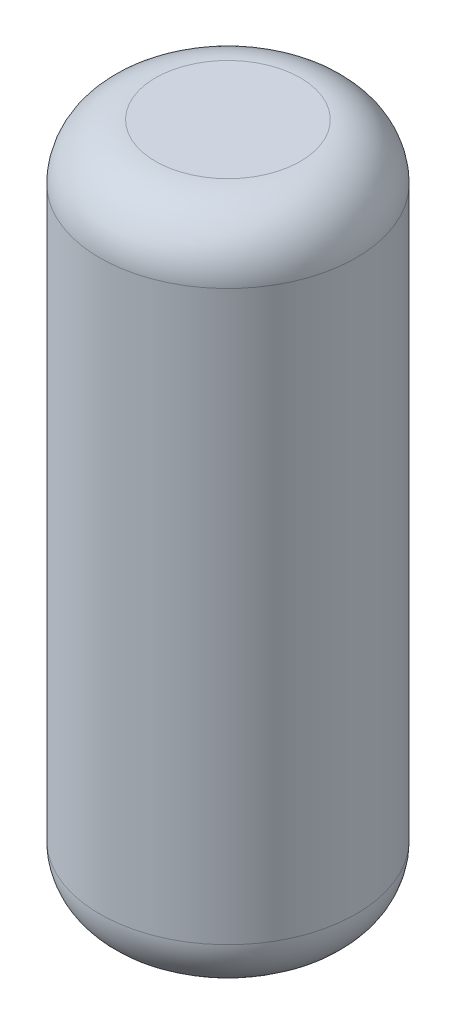
ISO-10303-21;
HEADER;
FILE_DESCRIPTION(('STEP AP214'),'2;1');
FILE_NAME('part.step','',(''),(''),'','','');
FILE_SCHEMA(('AUTOMOTIVE_DESIGN { 1 0 10303 214 1 1 1 1 }'));
ENDSEC;
DATA;
#1=APPLICATION_CONTEXT('core data for automotive mechanical design processes');
#2=APPLICATION_PROTOCOL_DEFINITION('international standard','automotive_design',2000,#1);
#3=PRODUCT_CONTEXT('',#1,'mechanical');
#4=PRODUCT('Part','Part','',(#3));
#5=PRODUCT_RELATED_PRODUCT_CATEGORY('part','',(#4));
#6=PRODUCT_DEFINITION_FORMATION('','',#4);
#7=PRODUCT_DEFINITION_CONTEXT('part definition',#1,'design');
#8=PRODUCT_DEFINITION('design','',#6,#7);
#9=PRODUCT_DEFINITION_SHAPE('','',#8);
#10=(LENGTH_UNIT() NAMED_UNIT(*) SI_UNIT(.MILLI.,.METRE.));
#11=(NAMED_UNIT(*) PLANE_ANGLE_UNIT() SI_UNIT($,.RADIAN.));
#12=(NAMED_UNIT(*) SI_UNIT($,.STERADIAN.) SOLID_ANGLE_UNIT());
#13=UNCERTAINTY_MEASURE_WITH_UNIT(LENGTH_MEASURE(1.E-05),#10,'distance_accuracy_value','');
#14=(GEOMETRIC_REPRESENTATION_CONTEXT(3) GLOBAL_UNCERTAINTY_ASSIGNED_CONTEXT((#13)) GLOBAL_UNIT_ASSIGNED_CONTEXT((#10,
#11,#12)) REPRESENTATION_CONTEXT('',''));
#15=CARTESIAN_POINT('',(0.,0.,0.));
#16=DIRECTION('',(0.,0.,1.));
#17=DIRECTION('',(1.,0.,0.));
#18=AXIS2_PLACEMENT_3D('',#15,#16,#17);
#19=CARTESIAN_POINT('',(0.,229.87,0.));
#20=DIRECTION('',(0.,1.,0.));
#21=DIRECTION('',(0.,0.,1.));
#22=AXIS2_PLACEMENT_3D('',#19,#20,#21);
#23=PLANE('',#22);
#24=CARTESIAN_POINT('',(0.,229.87,0.));
#25=DIRECTION('',(0.,-1.,0.));
#26=DIRECTION('',(0.,0.,-1.));
#27=AXIS2_PLACEMENT_3D('',#24,#25,#26);
#28=CIRCLE('',#27,49.5299999999998);
#29=CARTESIAN_POINT('',(0.,229.87,-49.5299999999998));
#30=VERTEX_POINT('',#29);
#31=EDGE_CURVE('E60',#30,#30,#28,.T.);
#32=ORIENTED_EDGE('',*,*,#31,.T.);
#33=EDGE_LOOP('',(#32));
#34=FACE_BOUND('',#33,.T.);
#35=ADVANCED_FACE('F37',(#34),#23,.F.);
#36=CARTESIAN_POINT('',(0.,194.31,0.));
#37=DIRECTION('',(0.,-1.,0.));
#38=DIRECTION('',(0.,0.,-1.));
#39=AXIS2_PLACEMENT_3D('',#36,#37,#38);
#40=TOROIDAL_SURFACE('',#39,49.53,35.56);
#41=ORIENTED_EDGE('',*,*,#31,.F.);
#42=EDGE_LOOP('',(#41));
#43=FACE_BOUND('',#42,.T.);
#44=CARTESIAN_POINT('',(0.,194.31,0.));
#45=DIRECTION('',(0.,-1.,0.));
#46=DIRECTION('',(0.,0.,-1.));
#47=AXIS2_PLACEMENT_3D('',#44,#45,#46);
#48=CIRCLE('',#47,85.09);
#49=CARTESIAN_POINT('',(0.,194.31,-85.09));
#50=VERTEX_POINT('',#49);
#51=EDGE_CURVE('E70',#50,#50,#48,.T.);
#52=ORIENTED_EDGE('',*,*,#51,.T.);
#53=EDGE_LOOP('',(#52));
#54=FACE_BOUND('',#53,.T.);
#55=ADVANCED_FACE('F113',(#43,#54),#40,.F.);
#56=CARTESIAN_POINT('',(0.,-232.41,0.));
#57=DIRECTION('',(0.,-1.,0.));
#58=DIRECTION('',(0.,0.,-1.));
#59=AXIS2_PLACEMENT_3D('',#56,#57,#58);
#60=CYLINDRICAL_SURFACE('',#59,85.09);
#61=ORIENTED_EDGE('',*,*,#51,.F.);
#62=EDGE_LOOP('',(#61));
#63=FACE_BOUND('',#62,.T.);
#64=CARTESIAN_POINT('',(0.,-194.31,0.));
#65=DIRECTION('',(0.,-1.,0.));
#66=DIRECTION('',(0.,0.,-1.));
#67=AXIS2_PLACEMENT_3D('',#64,#65,#66);
#68=CIRCLE('',#67,85.09);
#69=CARTESIAN_POINT('',(0.,-194.31,-85.09));
#70=VERTEX_POINT('',#69);
#71=EDGE_CURVE('E67',#70,#70,#68,.T.);
#72=ORIENTED_EDGE('',*,*,#71,.T.);
#73=EDGE_LOOP('',(#72));
#74=FACE_BOUND('',#73,.T.);
#75=ADVANCED_FACE('F119',(#63,#74),#60,.F.);
#76=CARTESIAN_POINT('',(0.,-194.31,0.));
#77=DIRECTION('',(0.,-1.,0.));
#78=DIRECTION('',(0.,0.,-1.));
#79=AXIS2_PLACEMENT_3D('',#76,#77,#78);
#80=TOROIDAL_SURFACE('',#79,49.53,35.56);
#81=ORIENTED_EDGE('',*,*,#71,.F.);
#82=EDGE_LOOP('',(#81));
#83=FACE_BOUND('',#82,.T.);
#84=CARTESIAN_POINT('',(0.,-229.87,0.));
#85=DIRECTION('',(0.,-1.,0.));
#86=DIRECTION('',(0.,0.,-1.));
#87=AXIS2_PLACEMENT_3D('',#84,#85,#86);
#88=CIRCLE('',#87,49.5299999999998);
#89=CARTESIAN_POINT('',(0.,-229.87,-49.5299999999998));
#90=VERTEX_POINT('',#89);
#91=EDGE_CURVE('E64',#90,#90,#88,.T.);
#92=ORIENTED_EDGE('',*,*,#91,.T.);
#93=EDGE_LOOP('',(#92));
#94=FACE_BOUND('',#93,.T.);
#95=ADVANCED_FACE('F126',(#83,#94),#80,.F.);
#96=CARTESIAN_POINT('',(0.,-229.87,0.));
#97=DIRECTION('',(0.,-1.,0.));
#98=DIRECTION('',(0.,0.,-1.));
#99=AXIS2_PLACEMENT_3D('',#96,#97,#98);
#100=PLANE('',#99);
#101=CARTESIAN_POINT('',(0.,-229.87,0.));
#102=DIRECTION('',(0.,-1.,0.));
#103=DIRECTION('',(0.,0.,-1.));
#104=AXIS2_PLACEMENT_3D('',#101,#102,#103);
#105=CIRCLE('',#104,10.16);
#106=CARTESIAN_POINT('',(0.,-229.87,10.16));
#107=VERTEX_POINT('',#106);
#108=EDGE_CURVE('E61',#107,#107,#105,.T.);
#109=ORIENTED_EDGE('',*,*,#108,.T.);
#110=EDGE_LOOP('',(#109));
#111=FACE_BOUND('',#110,.T.);
#112=ORIENTED_EDGE('',*,*,#91,.F.);
#113=EDGE_LOOP('',(#112));
#114=FACE_BOUND('',#113,.T.);
#115=ADVANCED_FACE('F130',(#111,#114),#100,.F.);
#116=CARTESIAN_POINT('',(0.,-251.46,0.));
#117=DIRECTION('',(0.,1.,0.));
#118=DIRECTION('',(0.,0.,1.));
#119=AXIS2_PLACEMENT_3D('',#116,#117,#118);
#120=CYLINDRICAL_SURFACE('',#119,10.16);
#121=CARTESIAN_POINT('',(0.,-232.41,0.));
#122=DIRECTION('',(0.,-1.,0.));
#123=DIRECTION('',(0.,0.,-1.));
#124=AXIS2_PLACEMENT_3D('',#121,#122,#123);
#125=CIRCLE('',#124,10.16);
#126=CARTESIAN_POINT('',(0.,-232.41,10.16));
#127=VERTEX_POINT('',#126);
#128=EDGE_CURVE('E41',#127,#127,#125,.T.);
#129=CARTESIAN_POINT('',(0.,-229.87,10.16));
#130=CARTESIAN_POINT('',(0.,-229.896458333333,10.16));
#131=CARTESIAN_POINT('',(0.,-229.922916666667,10.16));
#132=CARTESIAN_POINT('',(0.,-229.975833333333,10.16));
#133=CARTESIAN_POINT('',(0.,-230.002291666667,10.16));
#134=CARTESIAN_POINT('',(0.,-230.055208333333,10.16));
#135=CARTESIAN_POINT('',(0.,-230.081666666667,10.16));
#136=CARTESIAN_POINT('',(0.,-230.134583333333,10.16));
#137=CARTESIAN_POINT('',(0.,-230.161041666667,10.16));
#138=CARTESIAN_POINT('',(0.,-230.213958333333,10.16));
#139=CARTESIAN_POINT('',(0.,-230.240416666667,10.16));
#140=CARTESIAN_POINT('',(0.,-230.293333333333,10.16));
#141=CARTESIAN_POINT('',(0.,-230.319791666667,10.16));
#142=CARTESIAN_POINT('',(0.,-230.372708333333,10.16));
#143=CARTESIAN_POINT('',(0.,-230.399166666667,10.16));
#144=CARTESIAN_POINT('',(0.,-230.452083333333,10.16));
#145=CARTESIAN_POINT('',(0.,-230.478541666667,10.16));
#146=CARTESIAN_POINT('',(0.,-230.531458333333,10.16));
#147=CARTESIAN_POINT('',(0.,-230.557916666667,10.16));
#148=CARTESIAN_POINT('',(0.,-230.610833333333,10.16));
#149=CARTESIAN_POINT('',(0.,-230.637291666667,10.16));
#150=CARTESIAN_POINT('',(0.,-230.690208333333,10.16));
#151=CARTESIAN_POINT('',(0.,-230.716666666667,10.16));
#152=CARTESIAN_POINT('',(0.,-230.769583333333,10.16));
#153=CARTESIAN_POINT('',(0.,-230.796041666667,10.16));
#154=CARTESIAN_POINT('',(0.,-230.848958333333,10.16));
#155=CARTESIAN_POINT('',(0.,-230.875416666667,10.16));
#156=CARTESIAN_POINT('',(0.,-230.928333333333,10.16));
#157=CARTESIAN_POINT('',(0.,-230.954791666667,10.16));
#158=CARTESIAN_POINT('',(0.,-231.007708333333,10.16));
#159=CARTESIAN_POINT('',(0.,-231.034166666667,10.16));
#160=CARTESIAN_POINT('',(0.,-231.087083333333,10.16));
#161=CARTESIAN_POINT('',(0.,-231.113541666667,10.16));
#162=CARTESIAN_POINT('',(0.,-231.166458333333,10.16));
#163=CARTESIAN_POINT('',(0.,-231.192916666667,10.16));
#164=CARTESIAN_POINT('',(0.,-231.245833333333,10.16));
#165=CARTESIAN_POINT('',(0.,-231.272291666667,10.16));
#166=CARTESIAN_POINT('',(0.,-231.325208333333,10.16));
#167=CARTESIAN_POINT('',(0.,-231.351666666667,10.16));
#168=CARTESIAN_POINT('',(0.,-231.404583333333,10.16));
#169=CARTESIAN_POINT('',(0.,-231.431041666667,10.16));
#170=CARTESIAN_POINT('',(0.,-231.483958333333,10.16));
#171=CARTESIAN_POINT('',(0.,-231.510416666667,10.16));
#172=CARTESIAN_POINT('',(0.,-231.563333333333,10.16));
#173=CARTESIAN_POINT('',(0.,-231.589791666667,10.16));
#174=CARTESIAN_POINT('',(0.,-231.642708333333,10.16));
#175=CARTESIAN_POINT('',(0.,-231.669166666667,10.16));
#176=CARTESIAN_POINT('',(0.,-231.722083333333,10.16));
#177=CARTESIAN_POINT('',(0.,-231.748541666667,10.16));
#178=CARTESIAN_POINT('',(0.,-231.801458333333,10.16));
#179=CARTESIAN_POINT('',(0.,-231.827916666667,10.16));
#180=CARTESIAN_POINT('',(0.,-231.880833333333,10.16));
#181=CARTESIAN_POINT('',(0.,-231.907291666667,10.16));
#182=CARTESIAN_POINT('',(0.,-231.960208333333,10.16));
#183=CARTESIAN_POINT('',(0.,-231.986666666667,10.16));
#184=CARTESIAN_POINT('',(0.,-232.039583333333,10.16));
#185=CARTESIAN_POINT('',(0.,-232.066041666667,10.16));
#186=CARTESIAN_POINT('',(0.,-232.118958333333,10.16));
#187=CARTESIAN_POINT('',(0.,-232.145416666667,10.16));
#188=CARTESIAN_POINT('',(0.,-232.198333333333,10.16));
#189=CARTESIAN_POINT('',(0.,-232.224791666667,10.16));
#190=CARTESIAN_POINT('',(0.,-232.277708333333,10.16));
#191=CARTESIAN_POINT('',(0.,-232.304166666667,10.16));
#192=CARTESIAN_POINT('',(0.,-232.357083333333,10.16));
#193=CARTESIAN_POINT('',(0.,-232.383541666667,10.16));
#194=CARTESIAN_POINT('',(0.,-232.41,10.16));
#195=B_SPLINE_CURVE_WITH_KNOTS('',3,(#129,#130,#131,#132,#133,#134,#135,#136,#137,#138,#139,
#140,#141,#142,#143,#144,#145,#146,#147,#148,#149,#150,#151,#152,#153,#154,#155,#156,#157,#158,
#159,#160,#161,#162,#163,#164,#165,#166,#167,#168,#169,#170,#171,#172,#173,#174,#175,#176,#177,
#178,#179,#180,#181,#182,#183,#184,#185,#186,#187,#188,#189,#190,#191,#192,#193,#194),
.UNSPECIFIED.,.F.,.F.,(4,2,2,2,2,2,2,2,2,2,2,2,2,2,2,2,2,2,2,2,2,2,2,2,2,2,2,2,2,2,2,2,4),(0.,
0.0793750000000204,0.158750000000013,0.238125000000006,0.317499999999998,0.396875000000019,
0.476250000000011,0.555625000000004,0.635000000000024,0.714375000000017,0.79375000000001,
0.873125000000002,0.952500000000023,1.03187500000002,1.11125000000001,1.19062500000003,
1.27000000000002,1.34937500000001,1.42875000000003,1.50812500000003,1.58750000000002,
1.66687500000004,1.74625000000003,1.82562500000003,1.90500000000002,1.98437500000004,
2.06375000000003,2.14312500000002,2.22250000000004,2.30187500000004,2.38125000000003,
2.46062500000002,2.54000000000004),.UNSPECIFIED.);
#196=EDGE_CURVE('BSEAM133',#107,#127,#195,.T.);
#197=ORIENTED_EDGE('',*,*,#108,.F.);
#198=ORIENTED_EDGE('',*,*,#128,.T.);
#199=ORIENTED_EDGE('',*,*,#196,.T.);
#200=ORIENTED_EDGE('',*,*,#196,.F.);
#201=EDGE_LOOP('',(#197,#199,#198,#200));
#202=FACE_BOUND('',#201,.T.);
#203=ADVANCED_FACE('F133',(#202),#120,.F.);
#204=CARTESIAN_POINT('',(0.,-232.41,0.));
#205=DIRECTION('',(0.,-1.,0.));
#206=DIRECTION('',(0.,0.,-1.));
#207=AXIS2_PLACEMENT_3D('',#204,#205,#206);
#208=PLANE('',#207);
#209=CARTESIAN_POINT('',(0.,-232.41,0.));
#210=DIRECTION('',(0.,-1.,0.));
#211=DIRECTION('',(0.,0.,-1.));
#212=AXIS2_PLACEMENT_3D('',#209,#210,#211);
#213=CIRCLE('',#212,7.9375);
#214=CARTESIAN_POINT('',(0.,-232.41,-7.9375));
#215=VERTEX_POINT('',#214);
#216=EDGE_CURVE('E78',#215,#215,#213,.T.);
#217=ORIENTED_EDGE('',*,*,#216,.T.);
#218=EDGE_LOOP('',(#217));
#219=FACE_BOUND('',#218,.T.);
#220=ORIENTED_EDGE('',*,*,#128,.F.);
#221=EDGE_LOOP('',(#220));
#222=FACE_BOUND('',#221,.T.);
#223=ADVANCED_FACE('F85',(#219,#222),#208,.F.);
#224=CARTESIAN_POINT('',(0.,-232.41,0.));
#225=DIRECTION('',(0.,-1.,0.));
#226=DIRECTION('',(0.,0.,-1.));
#227=AXIS2_PLACEMENT_3D('',#224,#225,#226);
#228=CYLINDRICAL_SURFACE('',#227,7.9375);
#229=ORIENTED_EDGE('',*,*,#216,.F.);
#230=EDGE_LOOP('',(#229));
#231=FACE_BOUND('',#230,.T.);
#232=CARTESIAN_POINT('',(0.,-257.81,0.));
#233=DIRECTION('',(0.,-1.,0.));
#234=DIRECTION('',(0.,0.,-1.));
#235=AXIS2_PLACEMENT_3D('',#232,#233,#234);
#236=CIRCLE('',#235,7.9375);
#237=CARTESIAN_POINT('',(0.,-257.81,-7.9375));
#238=VERTEX_POINT('',#237);
#239=EDGE_CURVE('E79',#238,#238,#236,.T.);
#240=ORIENTED_EDGE('',*,*,#239,.T.);
#241=EDGE_LOOP('',(#240));
#242=FACE_BOUND('',#241,.T.);
#243=ADVANCED_FACE('F88',(#231,#242),#228,.F.);
#244=CARTESIAN_POINT('',(0.,232.41,0.));
#245=DIRECTION('',(0.,1.,0.));
#246=DIRECTION('',(0.,0.,1.));
#247=AXIS2_PLACEMENT_3D('',#244,#245,#246);
#248=PLANE('',#247);
#249=CARTESIAN_POINT('',(0.,232.41,0.));
#250=DIRECTION('',(0.,-1.,0.));
#251=DIRECTION('',(0.,0.,-1.));
#252=AXIS2_PLACEMENT_3D('',#249,#250,#251);
#253=CIRCLE('',#252,49.5299999999997);
#254=CARTESIAN_POINT('',(0.,232.41,-49.5299999999997));
#255=VERTEX_POINT('',#254);
#256=EDGE_CURVE('E10',#255,#255,#253,.T.);
#257=ORIENTED_EDGE('',*,*,#256,.F.);
#258=EDGE_LOOP('',(#257));
#259=FACE_BOUND('',#258,.T.);
#260=ADVANCED_FACE('F39',(#259),#248,.T.);
#261=CARTESIAN_POINT('',(0.,194.31,0.));
#262=DIRECTION('',(0.,-1.,0.));
#263=DIRECTION('',(0.,0.,-1.));
#264=AXIS2_PLACEMENT_3D('',#261,#262,#263);
#265=TOROIDAL_SURFACE('',#264,49.53,38.1);
#266=ORIENTED_EDGE('',*,*,#256,.T.);
#267=EDGE_LOOP('',(#266));
#268=FACE_BOUND('',#267,.T.);
#269=CARTESIAN_POINT('',(0.,194.31,0.));
#270=DIRECTION('',(0.,-1.,0.));
#271=DIRECTION('',(0.,0.,-1.));
#272=AXIS2_PLACEMENT_3D('',#269,#270,#271);
#273=CIRCLE('',#272,87.63);
#274=CARTESIAN_POINT('',(0.,194.31,-87.63));
#275=VERTEX_POINT('',#274);
#276=EDGE_CURVE('E45',#275,#275,#273,.T.);
#277=ORIENTED_EDGE('',*,*,#276,.F.);
#278=EDGE_LOOP('',(#277));
#279=FACE_BOUND('',#278,.T.);
#280=ADVANCED_FACE('F160',(#268,#279),#265,.T.);
#281=CARTESIAN_POINT('',(0.,-232.41,0.));
#282=DIRECTION('',(0.,-1.,0.));
#283=DIRECTION('',(0.,0.,-1.));
#284=AXIS2_PLACEMENT_3D('',#281,#282,#283);
#285=CYLINDRICAL_SURFACE('',#284,87.63);
#286=ORIENTED_EDGE('',*,*,#276,.T.);
#287=EDGE_LOOP('',(#286));
#288=FACE_BOUND('',#287,.T.);
#289=CARTESIAN_POINT('',(0.,-194.31,0.));
#290=DIRECTION('',(0.,-1.,0.));
#291=DIRECTION('',(0.,0.,-1.));
#292=AXIS2_PLACEMENT_3D('',#289,#290,#291);
#293=CIRCLE('',#292,87.63);
#294=CARTESIAN_POINT('',(0.,-194.31,-87.63));
#295=VERTEX_POINT('',#294);
#296=EDGE_CURVE('E49',#295,#295,#293,.T.);
#297=ORIENTED_EDGE('',*,*,#296,.F.);
#298=EDGE_LOOP('',(#297));
#299=FACE_BOUND('',#298,.T.);
#300=ADVANCED_FACE('F167',(#288,#299),#285,.T.);
#301=CARTESIAN_POINT('',(0.,-194.31,0.));
#302=DIRECTION('',(0.,-1.,0.));
#303=DIRECTION('',(0.,0.,-1.));
#304=AXIS2_PLACEMENT_3D('',#301,#302,#303);
#305=TOROIDAL_SURFACE('',#304,49.53,38.1);
#306=ORIENTED_EDGE('',*,*,#296,.T.);
#307=EDGE_LOOP('',(#306));
#308=FACE_BOUND('',#307,.T.);
#309=CARTESIAN_POINT('',(0.,-232.41,0.));
#310=DIRECTION('',(0.,-1.,0.));
#311=DIRECTION('',(0.,0.,-1.));
#312=AXIS2_PLACEMENT_3D('',#309,#310,#311);
#313=CIRCLE('',#312,49.5299999999998);
#314=CARTESIAN_POINT('',(0.,-232.41,-49.5299999999998));
#315=VERTEX_POINT('',#314);
#316=EDGE_CURVE('E54',#315,#315,#313,.T.);
#317=ORIENTED_EDGE('',*,*,#316,.F.);
#318=EDGE_LOOP('',(#317));
#319=FACE_BOUND('',#318,.T.);
#320=ADVANCED_FACE('F108',(#308,#319),#305,.T.);
#321=CARTESIAN_POINT('',(0.,-232.41,0.));
#322=DIRECTION('',(0.,-1.,0.));
#323=DIRECTION('',(0.,0.,-1.));
#324=AXIS2_PLACEMENT_3D('',#321,#322,#323);
#325=PLANE('',#324);
#326=CARTESIAN_POINT('',(0.,-232.41,0.));
#327=DIRECTION('',(0.,-1.,0.));
#328=DIRECTION('',(0.,0.,-1.));
#329=AXIS2_PLACEMENT_3D('',#326,#327,#328);
#330=CIRCLE('',#329,12.7);
#331=CARTESIAN_POINT('',(0.,-232.41,12.7));
#332=VERTEX_POINT('',#331);
#333=EDGE_CURVE('E57',#332,#332,#330,.T.);
#334=ORIENTED_EDGE('',*,*,#333,.F.);
#335=EDGE_LOOP('',(#334));
#336=FACE_BOUND('',#335,.T.);
#337=ORIENTED_EDGE('',*,*,#316,.T.);
#338=EDGE_LOOP('',(#337));
#339=FACE_BOUND('',#338,.T.);
#340=ADVANCED_FACE('F102',(#336,#339),#325,.T.);
#341=CARTESIAN_POINT('',(0.,-251.46,0.));
#342=DIRECTION('',(0.,1.,0.));
#343=DIRECTION('',(0.,0.,1.));
#344=AXIS2_PLACEMENT_3D('',#341,#342,#343);
#345=CYLINDRICAL_SURFACE('',#344,12.7);
#346=CARTESIAN_POINT('',(0.,-257.81,0.));
#347=DIRECTION('',(0.,-1.,0.));
#348=DIRECTION('',(0.,0.,-1.));
#349=AXIS2_PLACEMENT_3D('',#346,#347,#348);
#350=CIRCLE('',#349,12.7);
#351=CARTESIAN_POINT('',(0.,-257.81,12.7));
#352=VERTEX_POINT('',#351);
#353=EDGE_CURVE('E75',#352,#352,#350,.T.);
#354=CARTESIAN_POINT('',(0.,-232.41,12.7));
#355=CARTESIAN_POINT('',(0.,-232.674583333333,12.7));
#356=CARTESIAN_POINT('',(0.,-232.939166666667,12.7));
#357=CARTESIAN_POINT('',(0.,-233.468333333333,12.7));
#358=CARTESIAN_POINT('',(0.,-233.732916666667,12.7));
#359=CARTESIAN_POINT('',(0.,-234.262083333333,12.7));
#360=CARTESIAN_POINT('',(0.,-234.526666666667,12.7));
#361=CARTESIAN_POINT('',(0.,-235.055833333333,12.7));
#362=CARTESIAN_POINT('',(0.,-235.320416666667,12.7));
#363=CARTESIAN_POINT('',(0.,-235.849583333333,12.7));
#364=CARTESIAN_POINT('',(0.,-236.114166666667,12.7));
#365=CARTESIAN_POINT('',(0.,-236.643333333333,12.7));
#366=CARTESIAN_POINT('',(0.,-236.907916666667,12.7));
#367=CARTESIAN_POINT('',(0.,-237.437083333333,12.7));
#368=CARTESIAN_POINT('',(0.,-237.701666666667,12.7));
#369=CARTESIAN_POINT('',(0.,-238.230833333333,12.7));
#370=CARTESIAN_POINT('',(0.,-238.495416666667,12.7));
#371=CARTESIAN_POINT('',(0.,-239.024583333333,12.7));
#372=CARTESIAN_POINT('',(0.,-239.289166666667,12.7));
#373=CARTESIAN_POINT('',(0.,-239.818333333333,12.7));
#374=CARTESIAN_POINT('',(0.,-240.082916666667,12.7));
#375=CARTESIAN_POINT('',(0.,-240.612083333333,12.7));
#376=CARTESIAN_POINT('',(0.,-240.876666666667,12.7));
#377=CARTESIAN_POINT('',(0.,-241.405833333333,12.7));
#378=CARTESIAN_POINT('',(0.,-241.670416666667,12.7));
#379=CARTESIAN_POINT('',(0.,-242.199583333333,12.7));
#380=CARTESIAN_POINT('',(0.,-242.464166666667,12.7));
#381=CARTESIAN_POINT('',(0.,-242.993333333333,12.7));
#382=CARTESIAN_POINT('',(0.,-243.257916666667,12.7));
#383=CARTESIAN_POINT('',(0.,-243.787083333333,12.7));
#384=CARTESIAN_POINT('',(0.,-244.051666666667,12.7));
#385=CARTESIAN_POINT('',(0.,-244.580833333333,12.7));
#386=CARTESIAN_POINT('',(0.,-244.845416666667,12.7));
#387=CARTESIAN_POINT('',(0.,-245.374583333333,12.7));
#388=CARTESIAN_POINT('',(0.,-245.639166666667,12.7));
#389=CARTESIAN_POINT('',(0.,-246.168333333333,12.7));
#390=CARTESIAN_POINT('',(0.,-246.432916666667,12.7));
#391=CARTESIAN_POINT('',(0.,-246.962083333333,12.7));
#392=CARTESIAN_POINT('',(0.,-247.226666666667,12.7));
#393=CARTESIAN_POINT('',(0.,-247.755833333333,12.7));
#394=CARTESIAN_POINT('',(0.,-248.020416666667,12.7));
#395=CARTESIAN_POINT('',(0.,-248.549583333333,12.7));
#396=CARTESIAN_POINT('',(0.,-248.814166666667,12.7));
#397=CARTESIAN_POINT('',(0.,-249.343333333333,12.7));
#398=CARTESIAN_POINT('',(0.,-249.607916666667,12.7));
#399=CARTESIAN_POINT('',(0.,-250.137083333333,12.7));
#400=CARTESIAN_POINT('',(0.,-250.401666666667,12.7));
#401=CARTESIAN_POINT('',(0.,-250.930833333333,12.7));
#402=CARTESIAN_POINT('',(0.,-251.195416666667,12.7));
#403=CARTESIAN_POINT('',(0.,-251.724583333333,12.7));
#404=CARTESIAN_POINT('',(0.,-251.989166666667,12.7));
#405=CARTESIAN_POINT('',(0.,-252.518333333333,12.7));
#406=CARTESIAN_POINT('',(0.,-252.782916666667,12.7));
#407=CARTESIAN_POINT('',(0.,-253.312083333333,12.7));
#408=CARTESIAN_POINT('',(0.,-253.576666666667,12.7));
#409=CARTESIAN_POINT('',(0.,-254.105833333333,12.7));
#410=CARTESIAN_POINT('',(0.,-254.370416666667,12.7));
#411=CARTESIAN_POINT('',(0.,-254.899583333333,12.7));
#412=CARTESIAN_POINT('',(0.,-255.164166666667,12.7));
#413=CARTESIAN_POINT('',(0.,-255.693333333333,12.7));
#414=CARTESIAN_POINT('',(0.,-255.957916666667,12.7));
#415=CARTESIAN_POINT('',(0.,-256.487083333333,12.7));
#416=CARTESIAN_POINT('',(0.,-256.751666666667,12.7));
#417=CARTESIAN_POINT('',(0.,-257.280833333333,12.7));
#418=CARTESIAN_POINT('',(0.,-257.545416666667,12.7));
#419=CARTESIAN_POINT('',(0.,-257.81,12.7));
#420=B_SPLINE_CURVE_WITH_KNOTS('',3,(#354,#355,#356,#357,#358,#359,#360,#361,#362,#363,#364,
#365,#366,#367,#368,#369,#370,#371,#372,#373,#374,#375,#376,#377,#378,#379,#380,#381,#382,#383,
#384,#385,#386,#387,#388,#389,#390,#391,#392,#393,#394,#395,#396,#397,#398,#399,#400,#401,#402,
#403,#404,#405,#406,#407,#408,#409,#410,#411,#412,#413,#414,#415,#416,#417,#418,#419),
.UNSPECIFIED.,.F.,.F.,(4,2,2,2,2,2,2,2,2,2,2,2,2,2,2,2,2,2,2,2,2,2,2,2,2,2,2,2,2,2,2,2,4),(0.,
0.79375000000001,1.58750000000002,2.38125,3.17500000000001,3.96875000000002,4.7625,
5.55625000000001,6.35000000000002,7.14375,7.93750000000001,8.73125000000002,9.52500000000001,
10.31875,11.1125,11.90625,12.7,13.49375,14.2875,15.08125,15.875,16.66875,17.4625,18.25625,19.05,
19.84375,20.6375,21.43125,22.225,23.01875,23.8125,24.60625,25.4),.UNSPECIFIED.);
#421=EDGE_CURVE('BSEAM97',#332,#352,#420,.T.);
#422=ORIENTED_EDGE('',*,*,#333,.T.);
#423=ORIENTED_EDGE('',*,*,#353,.F.);
#424=ORIENTED_EDGE('',*,*,#421,.T.);
#425=ORIENTED_EDGE('',*,*,#421,.F.);
#426=EDGE_LOOP('',(#422,#424,#423,#425));
#427=FACE_BOUND('',#426,.T.);
#428=ADVANCED_FACE('F97',(#427),#345,.T.);
#429=CARTESIAN_POINT('',(0.,-257.81,0.));
#430=DIRECTION('',(0.,-1.,0.));
#431=DIRECTION('',(0.,0.,-1.));
#432=AXIS2_PLACEMENT_3D('',#429,#430,#431);
#433=PLANE('',#432);
#434=ORIENTED_EDGE('',*,*,#239,.F.);
#435=EDGE_LOOP('',(#434));
#436=FACE_BOUND('',#435,.T.);
#437=ORIENTED_EDGE('',*,*,#353,.T.);
#438=EDGE_LOOP('',(#437));
#439=FACE_BOUND('',#438,.T.);
#440=ADVANCED_FACE('F94',(#436,#439),#433,.T.);
#441=CLOSED_SHELL('',(#35,#55,#75,#95,#115,#203,#223,#243,#260,#280,#300,#320,#340,#428,#440));
#442=MANIFOLD_SOLID_BREP('B2',#441);
#443=ADVANCED_BREP_SHAPE_REPRESENTATION('',(#18,#442),#14);
#444=SHAPE_DEFINITION_REPRESENTATION(#9,#443);
ENDSEC;
END-ISO-10303-21;
